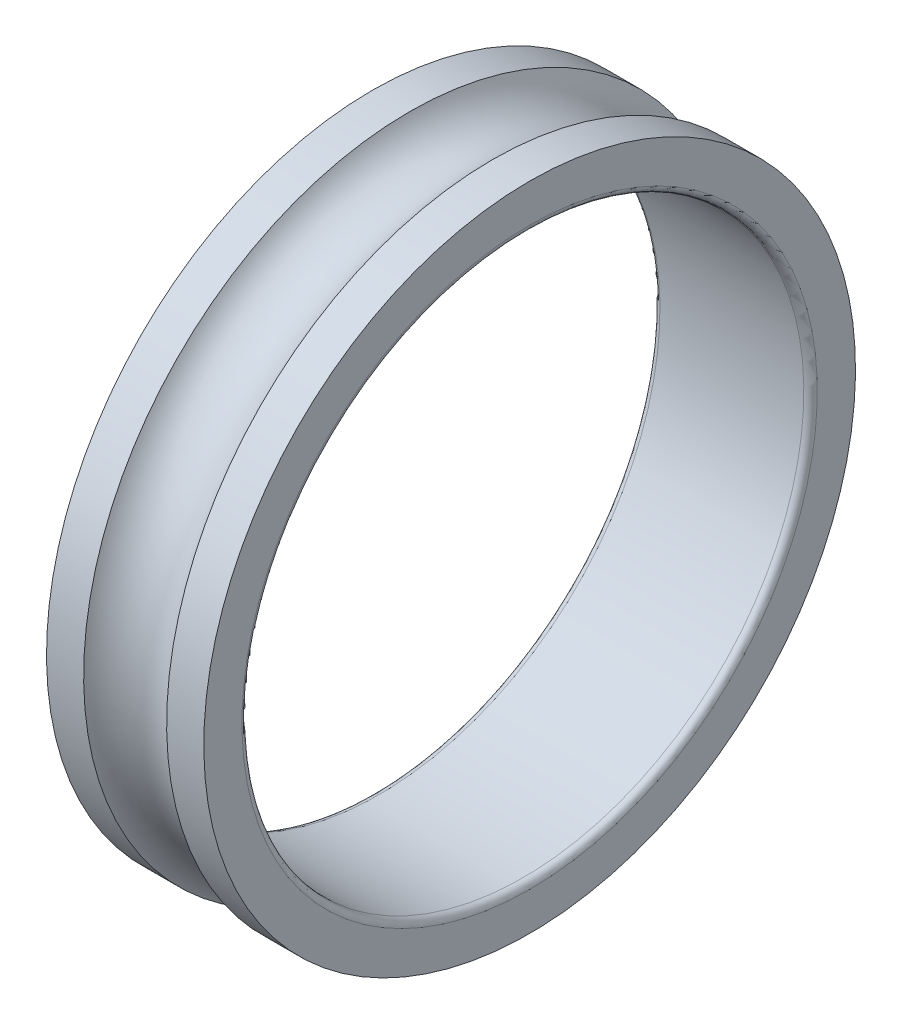
ISO-10303-21;
HEADER;
FILE_DESCRIPTION(('STEP AP214'),'2;1');
FILE_NAME('part.step','',(''),(''),'','','');
FILE_SCHEMA(('AUTOMOTIVE_DESIGN { 1 0 10303 214 1 1 1 1 }'));
ENDSEC;
DATA;
#1=APPLICATION_CONTEXT('core data for automotive mechanical design processes');
#2=APPLICATION_PROTOCOL_DEFINITION('international standard','automotive_design',2000,#1);
#3=PRODUCT_CONTEXT('',#1,'mechanical');
#4=PRODUCT('Part','Part','',(#3));
#5=PRODUCT_RELATED_PRODUCT_CATEGORY('part','',(#4));
#6=PRODUCT_DEFINITION_FORMATION('','',#4);
#7=PRODUCT_DEFINITION_CONTEXT('part definition',#1,'design');
#8=PRODUCT_DEFINITION('design','',#6,#7);
#9=PRODUCT_DEFINITION_SHAPE('','',#8);
#10=(LENGTH_UNIT() NAMED_UNIT(*) SI_UNIT(.MILLI.,.METRE.));
#11=(NAMED_UNIT(*) PLANE_ANGLE_UNIT() SI_UNIT($,.RADIAN.));
#12=(NAMED_UNIT(*) SI_UNIT($,.STERADIAN.) SOLID_ANGLE_UNIT());
#13=UNCERTAINTY_MEASURE_WITH_UNIT(LENGTH_MEASURE(1.E-05),#10,'distance_accuracy_value','');
#14=(GEOMETRIC_REPRESENTATION_CONTEXT(3) GLOBAL_UNCERTAINTY_ASSIGNED_CONTEXT((#13)) GLOBAL_UNIT_ASSIGNED_CONTEXT((#10,
#11,#12)) REPRESENTATION_CONTEXT('',''));
#15=CARTESIAN_POINT('',(0.,0.,0.));
#16=DIRECTION('',(0.,0.,1.));
#17=DIRECTION('',(1.,0.,0.));
#18=AXIS2_PLACEMENT_3D('',#15,#16,#17);
#19=CARTESIAN_POINT('',(-3.2,0.,0.));
#20=DIRECTION('',(1.,0.,0.));
#21=DIRECTION('',(0.,0.,-1.));
#22=AXIS2_PLACEMENT_3D('',#19,#20,#21);
#23=TOROIDAL_SURFACE('',#22,12.8,0.3);
#24=CARTESIAN_POINT('',(-3.2,0.,0.));
#25=DIRECTION('',(1.,0.,0.));
#26=DIRECTION('',(0.,1.,0.));
#27=AXIS2_PLACEMENT_3D('',#24,#25,#26);
#28=CIRCLE('',#27,12.5);
#29=CARTESIAN_POINT('',(-3.2,12.5,0.));
#30=VERTEX_POINT('',#29);
#31=EDGE_CURVE('E11',#30,#30,#28,.T.);
#32=ORIENTED_EDGE('',*,*,#31,.T.);
#33=EDGE_LOOP('',(#32));
#34=FACE_BOUND('',#33,.T.);
#35=CARTESIAN_POINT('',(-3.5,0.,0.));
#36=DIRECTION('',(1.,0.,0.));
#37=DIRECTION('',(0.,1.,0.));
#38=AXIS2_PLACEMENT_3D('',#35,#36,#37);
#39=CIRCLE('',#38,12.8);
#40=CARTESIAN_POINT('',(-3.5,12.8,0.));
#41=VERTEX_POINT('',#40);
#42=EDGE_CURVE('E61',#41,#41,#39,.T.);
#43=ORIENTED_EDGE('',*,*,#42,.F.);
#44=EDGE_LOOP('',(#43));
#45=FACE_BOUND('',#44,.T.);
#46=ADVANCED_FACE('F16',(#34,#45),#23,.T.);
#47=CARTESIAN_POINT('',(0.,0.,0.));
#48=DIRECTION('',(-1.,0.,0.));
#49=DIRECTION('',(0.,1.,0.));
#50=AXIS2_PLACEMENT_3D('',#47,#48,#49);
#51=CYLINDRICAL_SURFACE('',#50,12.5);
#52=CARTESIAN_POINT('',(3.2,0.,0.));
#53=DIRECTION('',(1.,0.,0.));
#54=DIRECTION('',(0.,1.,0.));
#55=AXIS2_PLACEMENT_3D('',#52,#53,#54);
#56=CIRCLE('',#55,12.5);
#57=CARTESIAN_POINT('',(3.2,12.5,0.));
#58=VERTEX_POINT('',#57);
#59=EDGE_CURVE('E26',#58,#58,#56,.T.);
#60=ORIENTED_EDGE('',*,*,#59,.T.);
#61=EDGE_LOOP('',(#60));
#62=FACE_BOUND('',#61,.T.);
#63=ORIENTED_EDGE('',*,*,#31,.F.);
#64=EDGE_LOOP('',(#63));
#65=FACE_BOUND('',#64,.T.);
#66=ADVANCED_FACE('F82',(#62,#65),#51,.F.);
#67=CARTESIAN_POINT('',(3.2,0.,0.));
#68=DIRECTION('',(1.,0.,0.));
#69=DIRECTION('',(0.,0.,-1.));
#70=AXIS2_PLACEMENT_3D('',#67,#68,#69);
#71=TOROIDAL_SURFACE('',#70,12.8,0.3);
#72=CARTESIAN_POINT('',(3.5,0.,0.));
#73=DIRECTION('',(1.,0.,0.));
#74=DIRECTION('',(0.,1.,0.));
#75=AXIS2_PLACEMENT_3D('',#72,#73,#74);
#76=CIRCLE('',#75,12.8);
#77=CARTESIAN_POINT('',(3.5,12.8,0.));
#78=VERTEX_POINT('',#77);
#79=EDGE_CURVE('E59',#78,#78,#76,.T.);
#80=ORIENTED_EDGE('',*,*,#79,.T.);
#81=EDGE_LOOP('',(#80));
#82=FACE_BOUND('',#81,.T.);
#83=ORIENTED_EDGE('',*,*,#59,.F.);
#84=EDGE_LOOP('',(#83));
#85=FACE_BOUND('',#84,.T.);
#86=ADVANCED_FACE('F87',(#82,#85),#71,.T.);
#87=CARTESIAN_POINT('',(3.5,13.65,0.));
#88=DIRECTION('',(1.,0.,0.));
#89=DIRECTION('',(0.,1.,0.));
#90=AXIS2_PLACEMENT_3D('',#87,#88,#89);
#91=PLANE('',#90);
#92=CARTESIAN_POINT('',(3.5,0.,0.));
#93=DIRECTION('',(1.,0.,0.));
#94=DIRECTION('',(0.,1.,0.));
#95=AXIS2_PLACEMENT_3D('',#92,#93,#94);
#96=CIRCLE('',#95,14.5);
#97=CARTESIAN_POINT('',(3.5,14.5,0.));
#98=VERTEX_POINT('',#97);
#99=EDGE_CURVE('E49',#98,#98,#96,.T.);
#100=ORIENTED_EDGE('',*,*,#99,.T.);
#101=EDGE_LOOP('',(#100));
#102=FACE_BOUND('',#101,.T.);
#103=ORIENTED_EDGE('',*,*,#79,.F.);
#104=EDGE_LOOP('',(#103));
#105=FACE_BOUND('',#104,.T.);
#106=ADVANCED_FACE('F93',(#102,#105),#91,.T.);
#107=CARTESIAN_POINT('',(2.67330926563097,0.,0.));
#108=DIRECTION('',(-1.,0.,0.));
#109=DIRECTION('',(0.,1.,0.));
#110=AXIS2_PLACEMENT_3D('',#107,#108,#109);
#111=CYLINDRICAL_SURFACE('',#110,14.5);
#112=CARTESIAN_POINT('',(1.84661853126194,0.,0.));
#113=DIRECTION('',(1.,0.,0.));
#114=DIRECTION('',(0.,1.,0.));
#115=AXIS2_PLACEMENT_3D('',#112,#113,#114);
#116=CIRCLE('',#115,14.5);
#117=CARTESIAN_POINT('',(1.84661853126194,14.5,0.));
#118=VERTEX_POINT('',#117);
#119=EDGE_CURVE('E53',#118,#118,#116,.T.);
#120=ORIENTED_EDGE('',*,*,#119,.T.);
#121=EDGE_LOOP('',(#120));
#122=FACE_BOUND('',#121,.T.);
#123=ORIENTED_EDGE('',*,*,#99,.F.);
#124=EDGE_LOOP('',(#123));
#125=FACE_BOUND('',#124,.T.);
#126=ADVANCED_FACE('F54',(#122,#125),#111,.T.);
#127=CARTESIAN_POINT('',(0.,0.,0.));
#128=DIRECTION('',(1.,0.,0.));
#129=DIRECTION('',(0.,0.,-1.));
#130=AXIS2_PLACEMENT_3D('',#127,#128,#129);
#131=TOROIDAL_SURFACE('',#130,15.5,2.1);
#132=CARTESIAN_POINT('',(-1.84661853126194,0.,0.));
#133=DIRECTION('',(1.,0.,0.));
#134=DIRECTION('',(0.,1.,0.));
#135=AXIS2_PLACEMENT_3D('',#132,#133,#134);
#136=CIRCLE('',#135,14.5);
#137=CARTESIAN_POINT('',(-1.84661853126194,14.5,0.));
#138=VERTEX_POINT('',#137);
#139=EDGE_CURVE('E57',#138,#138,#136,.T.);
#140=ORIENTED_EDGE('',*,*,#139,.T.);
#141=EDGE_LOOP('',(#140));
#142=FACE_BOUND('',#141,.T.);
#143=ORIENTED_EDGE('',*,*,#119,.F.);
#144=EDGE_LOOP('',(#143));
#145=FACE_BOUND('',#144,.T.);
#146=ADVANCED_FACE('F78',(#142,#145),#131,.F.);
#147=CARTESIAN_POINT('',(-2.67330926563097,0.,0.));
#148=DIRECTION('',(-1.,0.,0.));
#149=DIRECTION('',(0.,1.,0.));
#150=AXIS2_PLACEMENT_3D('',#147,#148,#149);
#151=CYLINDRICAL_SURFACE('',#150,14.5);
#152=CARTESIAN_POINT('',(-3.5,0.,0.));
#153=DIRECTION('',(1.,0.,0.));
#154=DIRECTION('',(0.,1.,0.));
#155=AXIS2_PLACEMENT_3D('',#152,#153,#154);
#156=CIRCLE('',#155,14.5);
#157=CARTESIAN_POINT('',(-3.5,14.5,0.));
#158=VERTEX_POINT('',#157);
#159=EDGE_CURVE('E20',#158,#158,#156,.T.);
#160=ORIENTED_EDGE('',*,*,#159,.T.);
#161=EDGE_LOOP('',(#160));
#162=FACE_BOUND('',#161,.T.);
#163=ORIENTED_EDGE('',*,*,#139,.F.);
#164=EDGE_LOOP('',(#163));
#165=FACE_BOUND('',#164,.T.);
#166=ADVANCED_FACE('F18',(#162,#165),#151,.T.);
#167=CARTESIAN_POINT('',(-3.5,13.65,0.));
#168=DIRECTION('',(-1.,0.,0.));
#169=DIRECTION('',(0.,-1.,0.));
#170=AXIS2_PLACEMENT_3D('',#167,#168,#169);
#171=PLANE('',#170);
#172=ORIENTED_EDGE('',*,*,#42,.T.);
#173=EDGE_LOOP('',(#172));
#174=FACE_BOUND('',#173,.T.);
#175=ORIENTED_EDGE('',*,*,#159,.F.);
#176=EDGE_LOOP('',(#175));
#177=FACE_BOUND('',#176,.T.);
#178=ADVANCED_FACE('F71',(#174,#177),#171,.T.);
#179=CLOSED_SHELL('',(#46,#66,#86,#106,#126,#146,#166,#178));
#180=MANIFOLD_SOLID_BREP('B1',#179);
#181=ADVANCED_BREP_SHAPE_REPRESENTATION('',(#18,#180),#14);
#182=SHAPE_DEFINITION_REPRESENTATION(#9,#181);
ENDSEC;
END-ISO-10303-21;
